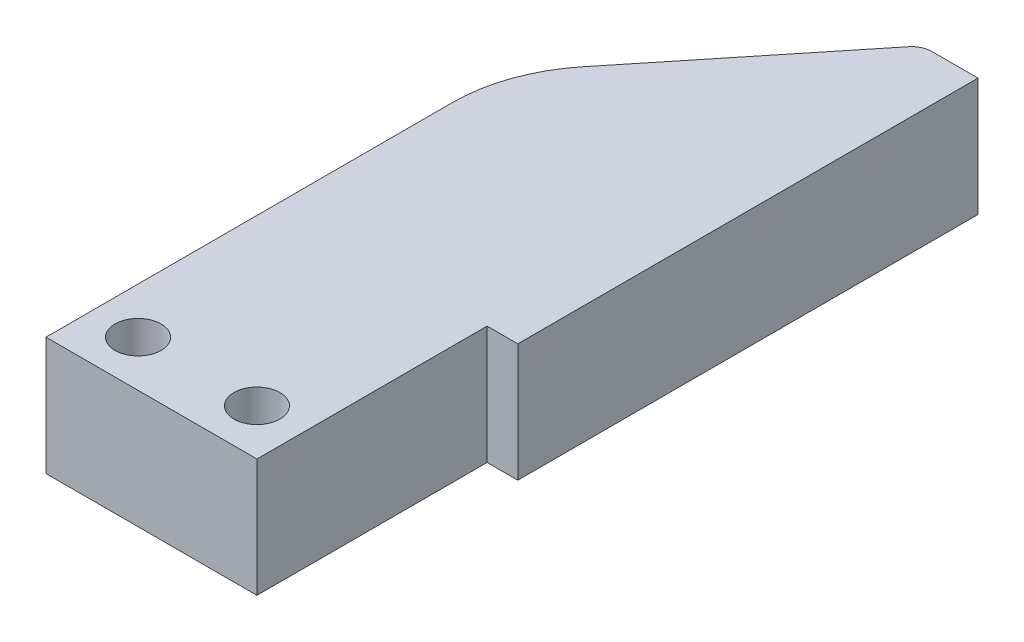
ISO-10303-21;
HEADER;
FILE_DESCRIPTION(('STEP AP214'),'2;1');
FILE_NAME('part.step','',(''),(''),'','','');
FILE_SCHEMA(('AUTOMOTIVE_DESIGN { 1 0 10303 214 1 1 1 1 }'));
ENDSEC;
DATA;
#1=APPLICATION_CONTEXT('core data for automotive mechanical design processes');
#2=APPLICATION_PROTOCOL_DEFINITION('international standard','automotive_design',2000,#1);
#3=PRODUCT_CONTEXT('',#1,'mechanical');
#4=PRODUCT('Part','Part','',(#3));
#5=PRODUCT_RELATED_PRODUCT_CATEGORY('part','',(#4));
#6=PRODUCT_DEFINITION_FORMATION('','',#4);
#7=PRODUCT_DEFINITION_CONTEXT('part definition',#1,'design');
#8=PRODUCT_DEFINITION('design','',#6,#7);
#9=PRODUCT_DEFINITION_SHAPE('','',#8);
#10=(LENGTH_UNIT() NAMED_UNIT(*) SI_UNIT(.MILLI.,.METRE.));
#11=(NAMED_UNIT(*) PLANE_ANGLE_UNIT() SI_UNIT($,.RADIAN.));
#12=(NAMED_UNIT(*) SI_UNIT($,.STERADIAN.) SOLID_ANGLE_UNIT());
#13=UNCERTAINTY_MEASURE_WITH_UNIT(LENGTH_MEASURE(1.E-05),#10,'distance_accuracy_value','');
#14=(GEOMETRIC_REPRESENTATION_CONTEXT(3) GLOBAL_UNCERTAINTY_ASSIGNED_CONTEXT((#13)) GLOBAL_UNIT_ASSIGNED_CONTEXT((#10,
#11,#12)) REPRESENTATION_CONTEXT('',''));
#15=CARTESIAN_POINT('',(0.,0.,0.));
#16=DIRECTION('',(0.,0.,1.));
#17=DIRECTION('',(1.,0.,0.));
#18=AXIS2_PLACEMENT_3D('',#15,#16,#17);
#19=CARTESIAN_POINT('',(-3.75,3.85,-11.4668726814975));
#20=DIRECTION('',(0.,-1.,0.));
#21=DIRECTION('',(0.,0.,-1.));
#22=AXIS2_PLACEMENT_3D('',#19,#20,#21);
#23=CYLINDRICAL_SURFACE('',#22,10.);
#24=CARTESIAN_POINT('',(-3.75,-3.85,-11.4668726814975));
#25=DIRECTION('',(0.,1.,0.));
#26=DIRECTION('',(0.,0.,1.));
#27=AXIS2_PLACEMENT_3D('',#24,#25,#26);
#28=CIRCLE('',#27,10.);
#29=CARTESIAN_POINT('',(-13.75,-3.85,-11.4668726814974));
#30=VERTEX_POINT('',#29);
#31=CARTESIAN_POINT('',(-11.5304663978605,-3.85,-17.7489378380972));
#32=VERTEX_POINT('',#31);
#33=EDGE_CURVE('E158',#30,#32,#28,.F.);
#34=ORIENTED_EDGE('',*,*,#33,.F.);
#35=DIRECTION('',(0.,-1.,0.));
#36=VECTOR('',#35,1.);
#37=CARTESIAN_POINT('',(-13.75,3.85,-11.4668726814974));
#38=LINE('',#37,#36);
#39=CARTESIAN_POINT('',(-13.75,3.85,-11.4668726814974));
#40=VERTEX_POINT('',#39);
#41=EDGE_CURVE('E11',#40,#30,#38,.T.);
#42=ORIENTED_EDGE('',*,*,#41,.F.);
#43=CARTESIAN_POINT('',(-3.75,3.85,-11.4668726814975));
#44=DIRECTION('',(0.,1.,0.));
#45=DIRECTION('',(0.,0.,1.));
#46=AXIS2_PLACEMENT_3D('',#43,#44,#45);
#47=CIRCLE('',#46,10.);
#48=CARTESIAN_POINT('',(-11.5304663978605,3.85,-17.7489378380972));
#49=VERTEX_POINT('',#48);
#50=EDGE_CURVE('E198',#40,#49,#47,.F.);
#51=ORIENTED_EDGE('',*,*,#50,.T.);
#52=DIRECTION('',(0.,-1.,0.));
#53=VECTOR('',#52,1.);
#54=CARTESIAN_POINT('',(-11.5304663978605,3.85,-17.7489378380972));
#55=LINE('',#54,#53);
#56=EDGE_CURVE('E62',#49,#32,#55,.T.);
#57=ORIENTED_EDGE('',*,*,#56,.T.);
#58=EDGE_LOOP('',(#34,#42,#51,#57));
#59=FACE_BOUND('',#58,.T.);
#60=ADVANCED_FACE('F45',(#59),#23,.T.);
#61=CARTESIAN_POINT('',(-13.75,3.85,0.));
#62=DIRECTION('',(-1.,0.,0.));
#63=DIRECTION('',(0.,0.,1.));
#64=AXIS2_PLACEMENT_3D('',#61,#62,#63);
#65=PLANE('',#64);
#66=DIRECTION('',(0.,0.,-1.));
#67=VECTOR('',#66,1.);
#68=CARTESIAN_POINT('',(-13.75,-3.85,0.));
#69=LINE('',#68,#67);
#70=CARTESIAN_POINT('',(-13.75,-3.85,15.));
#71=VERTEX_POINT('',#70);
#72=EDGE_CURVE('E161',#71,#30,#69,.T.);
#73=ORIENTED_EDGE('',*,*,#72,.F.);
#74=DIRECTION('',(0.,-1.,0.));
#75=VECTOR('',#74,1.);
#76=CARTESIAN_POINT('',(-13.75,3.85,15.));
#77=LINE('',#76,#75);
#78=CARTESIAN_POINT('',(-13.75,3.85,15.));
#79=VERTEX_POINT('',#78);
#80=EDGE_CURVE('E54',#79,#71,#77,.T.);
#81=ORIENTED_EDGE('',*,*,#80,.F.);
#82=DIRECTION('',(0.,0.,-1.));
#83=VECTOR('',#82,1.);
#84=CARTESIAN_POINT('',(-13.75,3.85,0.));
#85=LINE('',#84,#83);
#86=EDGE_CURVE('E229',#79,#40,#85,.T.);
#87=ORIENTED_EDGE('',*,*,#86,.T.);
#88=ORIENTED_EDGE('',*,*,#41,.T.);
#89=EDGE_LOOP('',(#73,#81,#87,#88));
#90=FACE_BOUND('',#89,.T.);
#91=ADVANCED_FACE('F228',(#90),#65,.T.);
#92=CARTESIAN_POINT('',(0.,3.85,15.));
#93=DIRECTION('',(0.,0.,-1.));
#94=DIRECTION('',(-1.,0.,0.));
#95=AXIS2_PLACEMENT_3D('',#92,#93,#94);
#96=PLANE('',#95);
#97=DIRECTION('',(1.,0.,0.));
#98=VECTOR('',#97,1.);
#99=CARTESIAN_POINT('',(0.,-3.85,15.));
#100=LINE('',#99,#98);
#101=CARTESIAN_POINT('',(0.,-3.85,15.));
#102=VERTEX_POINT('',#101);
#103=EDGE_CURVE('E165',#71,#102,#100,.T.);
#104=ORIENTED_EDGE('',*,*,#103,.T.);
#105=DIRECTION('',(0.,-1.,0.));
#106=VECTOR('',#105,1.);
#107=CARTESIAN_POINT('',(0.,3.85,15.));
#108=LINE('',#107,#106);
#109=CARTESIAN_POINT('',(0.,3.85,15.));
#110=VERTEX_POINT('',#109);
#111=EDGE_CURVE('E211',#110,#102,#108,.T.);
#112=ORIENTED_EDGE('',*,*,#111,.F.);
#113=DIRECTION('',(1.,0.,0.));
#114=VECTOR('',#113,1.);
#115=CARTESIAN_POINT('',(0.,3.85,15.));
#116=LINE('',#115,#114);
#117=EDGE_CURVE('E219',#79,#110,#116,.T.);
#118=ORIENTED_EDGE('',*,*,#117,.F.);
#119=ORIENTED_EDGE('',*,*,#80,.T.);
#120=EDGE_LOOP('',(#104,#112,#118,#119));
#121=FACE_BOUND('',#120,.T.);
#122=ADVANCED_FACE('F217',(#121),#96,.F.);
#123=CARTESIAN_POINT('',(0.,3.85,0.));
#124=DIRECTION('',(1.,0.,0.));
#125=DIRECTION('',(0.,0.,-1.));
#126=AXIS2_PLACEMENT_3D('',#123,#124,#125);
#127=PLANE('',#126);
#128=DIRECTION('',(0.,0.,1.));
#129=VECTOR('',#128,1.);
#130=CARTESIAN_POINT('',(0.,-3.85,0.));
#131=LINE('',#130,#129);
#132=CARTESIAN_POINT('',(0.,-3.85,0.));
#133=VERTEX_POINT('',#132);
#134=EDGE_CURVE('E169',#133,#102,#131,.T.);
#135=ORIENTED_EDGE('',*,*,#134,.F.);
#136=DIRECTION('',(0.,-1.,0.));
#137=VECTOR('',#136,1.);
#138=CARTESIAN_POINT('',(0.,3.85,0.));
#139=LINE('',#138,#137);
#140=CARTESIAN_POINT('',(0.,3.85,0.));
#141=VERTEX_POINT('',#140);
#142=EDGE_CURVE('E208',#141,#133,#139,.T.);
#143=ORIENTED_EDGE('',*,*,#142,.F.);
#144=DIRECTION('',(0.,0.,1.));
#145=VECTOR('',#144,1.);
#146=CARTESIAN_POINT('',(0.,3.85,0.));
#147=LINE('',#146,#145);
#148=EDGE_CURVE('E381',#141,#110,#147,.T.);
#149=ORIENTED_EDGE('',*,*,#148,.T.);
#150=ORIENTED_EDGE('',*,*,#111,.T.);
#151=EDGE_LOOP('',(#135,#143,#149,#150));
#152=FACE_BOUND('',#151,.T.);
#153=ADVANCED_FACE('F251',(#152),#127,.T.);
#154=CARTESIAN_POINT('',(0.,3.85,0.));
#155=DIRECTION('',(0.,0.,1.));
#156=DIRECTION('',(1.,0.,0.));
#157=AXIS2_PLACEMENT_3D('',#154,#155,#156);
#158=PLANE('',#157);
#159=DIRECTION('',(-1.,0.,0.));
#160=VECTOR('',#159,1.);
#161=CARTESIAN_POINT('',(0.,-3.85,0.));
#162=LINE('',#161,#160);
#163=CARTESIAN_POINT('',(2.,-3.85,0.));
#164=VERTEX_POINT('',#163);
#165=EDGE_CURVE('E173',#164,#133,#162,.T.);
#166=ORIENTED_EDGE('',*,*,#165,.F.);
#167=DIRECTION('',(0.,-1.,0.));
#168=VECTOR('',#167,1.);
#169=CARTESIAN_POINT('',(2.,3.85,0.));
#170=LINE('',#169,#168);
#171=CARTESIAN_POINT('',(2.,3.85,0.));
#172=VERTEX_POINT('',#171);
#173=EDGE_CURVE('E205',#172,#164,#170,.T.);
#174=ORIENTED_EDGE('',*,*,#173,.F.);
#175=DIRECTION('',(-1.,0.,0.));
#176=VECTOR('',#175,1.);
#177=CARTESIAN_POINT('',(0.,3.85,0.));
#178=LINE('',#177,#176);
#179=EDGE_CURVE('E378',#172,#141,#178,.T.);
#180=ORIENTED_EDGE('',*,*,#179,.T.);
#181=ORIENTED_EDGE('',*,*,#142,.T.);
#182=EDGE_LOOP('',(#166,#174,#180,#181));
#183=FACE_BOUND('',#182,.T.);
#184=ADVANCED_FACE('F256',(#183),#158,.T.);
#185=CARTESIAN_POINT('',(2.,3.85,0.));
#186=DIRECTION('',(1.,0.,0.));
#187=DIRECTION('',(0.,0.,-1.));
#188=AXIS2_PLACEMENT_3D('',#185,#186,#187);
#189=PLANE('',#188);
#190=DIRECTION('',(0.,0.,1.));
#191=VECTOR('',#190,1.);
#192=CARTESIAN_POINT('',(2.,-3.85,0.));
#193=LINE('',#192,#191);
#194=CARTESIAN_POINT('',(2.,-3.85,-30.));
#195=VERTEX_POINT('',#194);
#196=EDGE_CURVE('E177',#195,#164,#193,.T.);
#197=ORIENTED_EDGE('',*,*,#196,.F.);
#198=DIRECTION('',(0.,-1.,0.));
#199=VECTOR('',#198,1.);
#200=CARTESIAN_POINT('',(2.,3.85,-30.));
#201=LINE('',#200,#199);
#202=CARTESIAN_POINT('',(2.,3.85,-30.));
#203=VERTEX_POINT('',#202);
#204=EDGE_CURVE('E128',#203,#195,#201,.T.);
#205=ORIENTED_EDGE('',*,*,#204,.F.);
#206=DIRECTION('',(0.,0.,1.));
#207=VECTOR('',#206,1.);
#208=CARTESIAN_POINT('',(2.,3.85,0.));
#209=LINE('',#208,#207);
#210=EDGE_CURVE('E139',#203,#172,#209,.T.);
#211=ORIENTED_EDGE('',*,*,#210,.T.);
#212=ORIENTED_EDGE('',*,*,#173,.T.);
#213=EDGE_LOOP('',(#197,#205,#211,#212));
#214=FACE_BOUND('',#213,.T.);
#215=ADVANCED_FACE('F260',(#214),#189,.T.);
#216=CARTESIAN_POINT('',(0.,3.85,-30.));
#217=DIRECTION('',(0.,0.,-1.));
#218=DIRECTION('',(-1.,0.,0.));
#219=AXIS2_PLACEMENT_3D('',#216,#217,#218);
#220=PLANE('',#219);
#221=DIRECTION('',(1.,0.,0.));
#222=VECTOR('',#221,1.);
#223=CARTESIAN_POINT('',(0.,-3.85,-30.));
#224=LINE('',#223,#222);
#225=CARTESIAN_POINT('',(-1.,-3.85,-30.));
#226=VERTEX_POINT('',#225);
#227=EDGE_CURVE('E123',#226,#195,#224,.T.);
#228=ORIENTED_EDGE('',*,*,#227,.F.);
#229=DIRECTION('',(0.,-1.,0.));
#230=VECTOR('',#229,1.);
#231=CARTESIAN_POINT('',(-1.,3.85,-30.));
#232=LINE('',#231,#230);
#233=CARTESIAN_POINT('',(-1.,3.85,-30.));
#234=VERTEX_POINT('',#233);
#235=EDGE_CURVE('E118',#234,#226,#232,.T.);
#236=ORIENTED_EDGE('',*,*,#235,.F.);
#237=DIRECTION('',(1.,0.,0.));
#238=VECTOR('',#237,1.);
#239=CARTESIAN_POINT('',(0.,3.85,-30.));
#240=LINE('',#239,#238);
#241=EDGE_CURVE('E121',#234,#203,#240,.T.);
#242=ORIENTED_EDGE('',*,*,#241,.T.);
#243=ORIENTED_EDGE('',*,*,#204,.T.);
#244=EDGE_LOOP('',(#228,#236,#242,#243));
#245=FACE_BOUND('',#244,.T.);
#246=ADVANCED_FACE('F120',(#245),#220,.T.);
#247=CARTESIAN_POINT('',(-0.999999999999999,3.85,-28.6632446685966));
#248=DIRECTION('',(0.,-1.,0.));
#249=DIRECTION('',(0.,0.,-1.));
#250=AXIS2_PLACEMENT_3D('',#247,#248,#249);
#251=CYLINDRICAL_SURFACE('',#250,1.33675533140341);
#252=CARTESIAN_POINT('',(-0.999999999999999,-3.85,-28.6632446685966));
#253=DIRECTION('',(0.,1.,0.));
#254=DIRECTION('',(0.,0.,1.));
#255=AXIS2_PLACEMENT_3D('',#252,#253,#254);
#256=CIRCLE('',#255,1.33675533140341);
#257=CARTESIAN_POINT('',(-2.04005799381451,-3.85,-29.5030030776274));
#258=VERTEX_POINT('',#257);
#259=EDGE_CURVE('E183',#258,#226,#256,.F.);
#260=ORIENTED_EDGE('',*,*,#259,.F.);
#261=DIRECTION('',(0.,-1.,0.));
#262=VECTOR('',#261,1.);
#263=CARTESIAN_POINT('',(-2.04005799381451,3.85,-29.5030030776274));
#264=LINE('',#263,#262);
#265=CARTESIAN_POINT('',(-2.04005799381451,3.85,-29.5030030776274));
#266=VERTEX_POINT('',#265);
#267=EDGE_CURVE('E90',#266,#258,#264,.T.);
#268=ORIENTED_EDGE('',*,*,#267,.F.);
#269=CARTESIAN_POINT('',(-0.999999999999999,3.85,-28.6632446685966));
#270=DIRECTION('',(0.,1.,0.));
#271=DIRECTION('',(0.,0.,1.));
#272=AXIS2_PLACEMENT_3D('',#269,#270,#271);
#273=CIRCLE('',#272,1.33675533140341);
#274=EDGE_CURVE('E136',#266,#234,#273,.F.);
#275=ORIENTED_EDGE('',*,*,#274,.T.);
#276=ORIENTED_EDGE('',*,*,#235,.T.);
#277=EDGE_LOOP('',(#260,#268,#275,#276));
#278=FACE_BOUND('',#277,.T.);
#279=ADVANCED_FACE('F142',(#278),#251,.T.);
#280=CARTESIAN_POINT('',(-10.75,3.85,12.));
#281=DIRECTION('',(0.,-1.,0.));
#282=DIRECTION('',(0.,0.,-1.));
#283=AXIS2_PLACEMENT_3D('',#280,#281,#282);
#284=CYLINDRICAL_SURFACE('',#283,1.5);
#285=CARTESIAN_POINT('',(-10.75,3.85,12.));
#286=DIRECTION('',(0.,1.,0.));
#287=DIRECTION('',(0.,0.,1.));
#288=AXIS2_PLACEMENT_3D('',#285,#286,#287);
#289=CIRCLE('',#288,1.5);
#290=CARTESIAN_POINT('',(-10.75,3.85,13.5));
#291=VERTEX_POINT('',#290);
#292=EDGE_CURVE('E147',#291,#291,#289,.T.);
#293=ORIENTED_EDGE('',*,*,#292,.T.);
#294=EDGE_LOOP('',(#293));
#295=FACE_BOUND('',#294,.T.);
#296=CARTESIAN_POINT('',(-10.75,-3.85,12.));
#297=DIRECTION('',(0.,1.,0.));
#298=DIRECTION('',(0.,0.,1.));
#299=AXIS2_PLACEMENT_3D('',#296,#297,#298);
#300=CIRCLE('',#299,1.5);
#301=CARTESIAN_POINT('',(-10.75,-3.85,13.5));
#302=VERTEX_POINT('',#301);
#303=EDGE_CURVE('E190',#302,#302,#300,.T.);
#304=ORIENTED_EDGE('',*,*,#303,.F.);
#305=EDGE_LOOP('',(#304));
#306=FACE_BOUND('',#305,.T.);
#307=ADVANCED_FACE('F233',(#295,#306),#284,.F.);
#308=CARTESIAN_POINT('',(-15.6552624171466,3.85,-12.6402934630275));
#309=DIRECTION('',(-0.778046639786049,0.,-0.628206515659969));
#310=DIRECTION('',(-0.628206515659969,0.,0.778046639786049));
#311=AXIS2_PLACEMENT_3D('',#308,#309,#310);
#312=PLANE('',#311);
#313=DIRECTION('',(0.628206515659969,0.,-0.778046639786049));
#314=VECTOR('',#313,1.);
#315=CARTESIAN_POINT('',(-15.6552624171466,-3.85,-12.6402934630275));
#316=LINE('',#315,#314);
#317=EDGE_CURVE('E186',#32,#258,#316,.T.);
#318=ORIENTED_EDGE('',*,*,#317,.F.);
#319=ORIENTED_EDGE('',*,*,#56,.F.);
#320=DIRECTION('',(0.628206515659969,0.,-0.778046639786049));
#321=VECTOR('',#320,1.);
#322=CARTESIAN_POINT('',(-15.6552624171466,3.85,-12.6402934630275));
#323=LINE('',#322,#321);
#324=EDGE_CURVE('E144',#49,#266,#323,.T.);
#325=ORIENTED_EDGE('',*,*,#324,.T.);
#326=ORIENTED_EDGE('',*,*,#267,.T.);
#327=EDGE_LOOP('',(#318,#319,#325,#326));
#328=FACE_BOUND('',#327,.T.);
#329=ADVANCED_FACE('F230',(#328),#312,.T.);
#330=CARTESIAN_POINT('',(-3.,3.85,12.));
#331=DIRECTION('',(0.,-1.,0.));
#332=DIRECTION('',(0.,0.,-1.));
#333=AXIS2_PLACEMENT_3D('',#330,#331,#332);
#334=CYLINDRICAL_SURFACE('',#333,1.5);
#335=CARTESIAN_POINT('',(-3.,3.85,12.));
#336=DIRECTION('',(0.,1.,0.));
#337=DIRECTION('',(0.,0.,1.));
#338=AXIS2_PLACEMENT_3D('',#335,#336,#337);
#339=CIRCLE('',#338,1.5);
#340=CARTESIAN_POINT('',(-3.,3.85,13.5));
#341=VERTEX_POINT('',#340);
#342=EDGE_CURVE('E154',#341,#341,#339,.F.);
#343=ORIENTED_EDGE('',*,*,#342,.F.);
#344=EDGE_LOOP('',(#343));
#345=FACE_BOUND('',#344,.T.);
#346=CARTESIAN_POINT('',(-3.,-3.85,12.));
#347=DIRECTION('',(0.,1.,0.));
#348=DIRECTION('',(0.,0.,1.));
#349=AXIS2_PLACEMENT_3D('',#346,#347,#348);
#350=CIRCLE('',#349,1.5);
#351=CARTESIAN_POINT('',(-3.,-3.85,13.5));
#352=VERTEX_POINT('',#351);
#353=EDGE_CURVE('E194',#352,#352,#350,.F.);
#354=ORIENTED_EDGE('',*,*,#353,.T.);
#355=EDGE_LOOP('',(#354));
#356=FACE_BOUND('',#355,.T.);
#357=ADVANCED_FACE('F232',(#345,#356),#334,.F.);
#358=CARTESIAN_POINT('',(0.,3.85,0.));
#359=DIRECTION('',(0.,1.,0.));
#360=DIRECTION('',(0.,0.,1.));
#361=AXIS2_PLACEMENT_3D('',#358,#359,#360);
#362=PLANE('',#361);
#363=ORIENTED_EDGE('',*,*,#50,.F.);
#364=ORIENTED_EDGE('',*,*,#86,.F.);
#365=ORIENTED_EDGE('',*,*,#117,.T.);
#366=ORIENTED_EDGE('',*,*,#148,.F.);
#367=ORIENTED_EDGE('',*,*,#179,.F.);
#368=ORIENTED_EDGE('',*,*,#210,.F.);
#369=ORIENTED_EDGE('',*,*,#241,.F.);
#370=ORIENTED_EDGE('',*,*,#274,.F.);
#371=ORIENTED_EDGE('',*,*,#324,.F.);
#372=EDGE_LOOP('',(#363,#364,#365,#366,#367,#368,#369,#370,#371));
#373=FACE_BOUND('',#372,.T.);
#374=ORIENTED_EDGE('',*,*,#292,.F.);
#375=EDGE_LOOP('',(#374));
#376=FACE_BOUND('',#375,.T.);
#377=ORIENTED_EDGE('',*,*,#342,.T.);
#378=EDGE_LOOP('',(#377));
#379=FACE_BOUND('',#378,.T.);
#380=ADVANCED_FACE('F133',(#373,#376,#379),#362,.T.);
#381=CARTESIAN_POINT('',(0.,-3.85,0.));
#382=DIRECTION('',(0.,1.,0.));
#383=DIRECTION('',(0.,0.,1.));
#384=AXIS2_PLACEMENT_3D('',#381,#382,#383);
#385=PLANE('',#384);
#386=ORIENTED_EDGE('',*,*,#33,.T.);
#387=ORIENTED_EDGE('',*,*,#317,.T.);
#388=ORIENTED_EDGE('',*,*,#259,.T.);
#389=ORIENTED_EDGE('',*,*,#227,.T.);
#390=ORIENTED_EDGE('',*,*,#196,.T.);
#391=ORIENTED_EDGE('',*,*,#165,.T.);
#392=ORIENTED_EDGE('',*,*,#134,.T.);
#393=ORIENTED_EDGE('',*,*,#103,.F.);
#394=ORIENTED_EDGE('',*,*,#72,.T.);
#395=EDGE_LOOP('',(#386,#387,#388,#389,#390,#391,#392,#393,#394));
#396=FACE_BOUND('',#395,.T.);
#397=ORIENTED_EDGE('',*,*,#303,.T.);
#398=EDGE_LOOP('',(#397));
#399=FACE_BOUND('',#398,.T.);
#400=ORIENTED_EDGE('',*,*,#353,.F.);
#401=EDGE_LOOP('',(#400));
#402=FACE_BOUND('',#401,.T.);
#403=ADVANCED_FACE('F225',(#396,#399,#402),#385,.F.);
#404=CLOSED_SHELL('',(#60,#91,#122,#153,#184,#215,#246,#279,#307,#329,#357,#380,#403));
#405=MANIFOLD_SOLID_BREP('B2',#404);
#406=ADVANCED_BREP_SHAPE_REPRESENTATION('',(#18,#405),#14);
#407=SHAPE_DEFINITION_REPRESENTATION(#9,#406);
ENDSEC;
END-ISO-10303-21;
